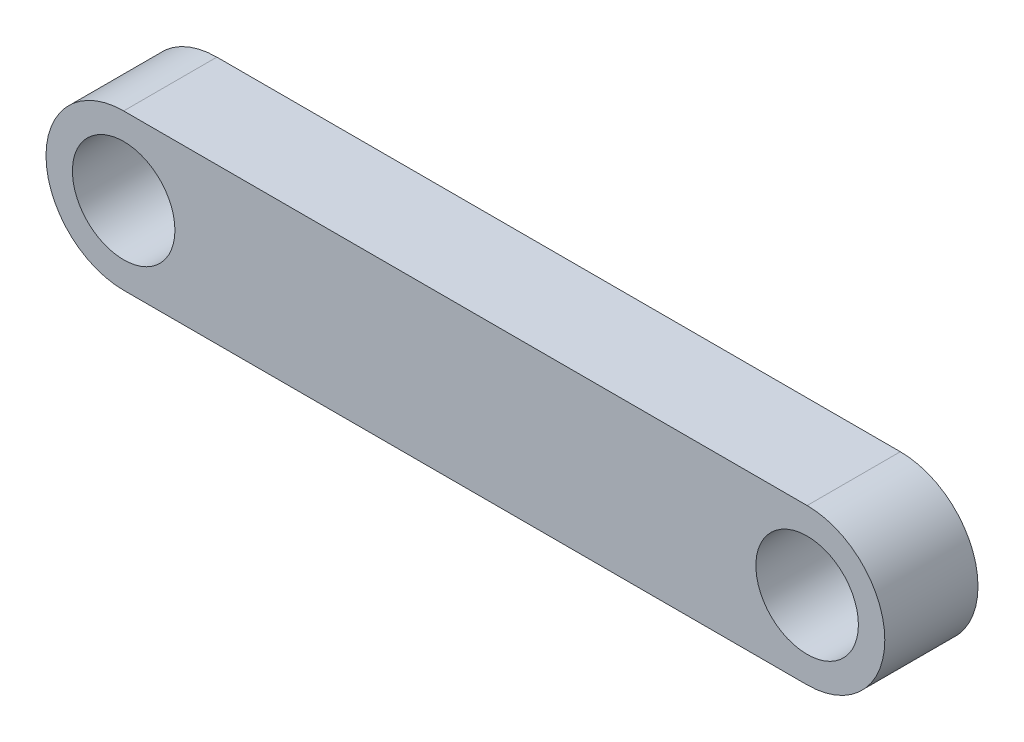
ISO-10303-21;
HEADER;
FILE_DESCRIPTION(('STEP AP214'),'2;1');
FILE_NAME('part.step','',(''),(''),'','','');
FILE_SCHEMA(('AUTOMOTIVE_DESIGN { 1 0 10303 214 1 1 1 1 }'));
ENDSEC;
DATA;
#1=APPLICATION_CONTEXT('core data for automotive mechanical design processes');
#2=APPLICATION_PROTOCOL_DEFINITION('international standard','automotive_design',2000,#1);
#3=PRODUCT_CONTEXT('',#1,'mechanical');
#4=PRODUCT('Part','Part','',(#3));
#5=PRODUCT_RELATED_PRODUCT_CATEGORY('part','',(#4));
#6=PRODUCT_DEFINITION_FORMATION('','',#4);
#7=PRODUCT_DEFINITION_CONTEXT('part definition',#1,'design');
#8=PRODUCT_DEFINITION('design','',#6,#7);
#9=PRODUCT_DEFINITION_SHAPE('','',#8);
#10=(LENGTH_UNIT() NAMED_UNIT(*) SI_UNIT(.MILLI.,.METRE.));
#11=(NAMED_UNIT(*) PLANE_ANGLE_UNIT() SI_UNIT($,.RADIAN.));
#12=(NAMED_UNIT(*) SI_UNIT($,.STERADIAN.) SOLID_ANGLE_UNIT());
#13=UNCERTAINTY_MEASURE_WITH_UNIT(LENGTH_MEASURE(1.E-05),#10,'distance_accuracy_value','');
#14=(GEOMETRIC_REPRESENTATION_CONTEXT(3) GLOBAL_UNCERTAINTY_ASSIGNED_CONTEXT((#13)) GLOBAL_UNIT_ASSIGNED_CONTEXT((#10,
#11,#12)) REPRESENTATION_CONTEXT('',''));
#15=CARTESIAN_POINT('',(0.,0.,0.));
#16=DIRECTION('',(0.,0.,1.));
#17=DIRECTION('',(1.,0.,0.));
#18=AXIS2_PLACEMENT_3D('',#15,#16,#17);
#19=CARTESIAN_POINT('',(0.,0.,3.));
#20=DIRECTION('',(0.,0.,1.));
#21=DIRECTION('',(1.,0.,0.));
#22=AXIS2_PLACEMENT_3D('',#19,#20,#21);
#23=PLANE('',#22);
#24=CARTESIAN_POINT('',(0.,0.,3.));
#25=DIRECTION('',(0.,0.,1.));
#26=DIRECTION('',(1.,0.,0.));
#27=AXIS2_PLACEMENT_3D('',#24,#25,#26);
#28=CIRCLE('',#27,1.65);
#29=CARTESIAN_POINT('',(1.65,0.,3.));
#30=VERTEX_POINT('',#29);
#31=EDGE_CURVE('E108',#30,#30,#28,.T.);
#32=ORIENTED_EDGE('',*,*,#31,.F.);
#33=EDGE_LOOP('',(#32));
#34=FACE_BOUND('',#33,.T.);
#35=CARTESIAN_POINT('',(0.,0.,3.));
#36=DIRECTION('',(0.,0.,1.));
#37=DIRECTION('',(1.,0.,0.));
#38=AXIS2_PLACEMENT_3D('',#35,#36,#37);
#39=CIRCLE('',#38,2.5);
#40=CARTESIAN_POINT('',(0.,2.5,3.));
#41=VERTEX_POINT('',#40);
#42=CARTESIAN_POINT('',(0.,-2.5,3.));
#43=VERTEX_POINT('',#42);
#44=EDGE_CURVE('E93',#41,#43,#39,.T.);
#45=ORIENTED_EDGE('',*,*,#44,.T.);
#46=DIRECTION('',(1.,0.,0.));
#47=VECTOR('',#46,1.);
#48=CARTESIAN_POINT('',(22.,-2.5,3.));
#49=LINE('',#48,#47);
#50=CARTESIAN_POINT('',(22.,-2.5,3.));
#51=VERTEX_POINT('',#50);
#52=EDGE_CURVE('E88',#43,#51,#49,.T.);
#53=ORIENTED_EDGE('',*,*,#52,.T.);
#54=CARTESIAN_POINT('',(22.,0.,3.));
#55=DIRECTION('',(0.,0.,1.));
#56=DIRECTION('',(1.,0.,0.));
#57=AXIS2_PLACEMENT_3D('',#54,#55,#56);
#58=CIRCLE('',#57,2.5);
#59=CARTESIAN_POINT('',(22.,2.5,3.));
#60=VERTEX_POINT('',#59);
#61=EDGE_CURVE('E91',#51,#60,#58,.T.);
#62=ORIENTED_EDGE('',*,*,#61,.T.);
#63=DIRECTION('',(-1.,0.,0.));
#64=VECTOR('',#63,1.);
#65=CARTESIAN_POINT('',(0.,2.5,3.));
#66=LINE('',#65,#64);
#67=EDGE_CURVE('E58',#60,#41,#66,.T.);
#68=ORIENTED_EDGE('',*,*,#67,.T.);
#69=EDGE_LOOP('',(#45,#53,#62,#68));
#70=FACE_BOUND('',#69,.T.);
#71=CARTESIAN_POINT('',(22.,0.,3.));
#72=DIRECTION('',(0.,0.,1.));
#73=DIRECTION('',(1.,0.,0.));
#74=AXIS2_PLACEMENT_3D('',#71,#72,#73);
#75=CIRCLE('',#74,1.65);
#76=CARTESIAN_POINT('',(23.65,0.,3.));
#77=VERTEX_POINT('',#76);
#78=EDGE_CURVE('E123',#77,#77,#75,.T.);
#79=ORIENTED_EDGE('',*,*,#78,.F.);
#80=EDGE_LOOP('',(#79));
#81=FACE_BOUND('',#80,.T.);
#82=ADVANCED_FACE('F41',(#34,#70,#81),#23,.T.);
#83=CARTESIAN_POINT('',(0.,0.,0.));
#84=DIRECTION('',(0.,0.,1.));
#85=DIRECTION('',(1.,0.,0.));
#86=AXIS2_PLACEMENT_3D('',#83,#84,#85);
#87=PLANE('',#86);
#88=CARTESIAN_POINT('',(0.,0.,0.));
#89=DIRECTION('',(0.,0.,1.));
#90=DIRECTION('',(1.,0.,0.));
#91=AXIS2_PLACEMENT_3D('',#88,#89,#90);
#92=CIRCLE('',#91,2.5);
#93=CARTESIAN_POINT('',(0.,2.5,0.));
#94=VERTEX_POINT('',#93);
#95=CARTESIAN_POINT('',(0.,-2.5,0.));
#96=VERTEX_POINT('',#95);
#97=EDGE_CURVE('E105',#94,#96,#92,.T.);
#98=ORIENTED_EDGE('',*,*,#97,.F.);
#99=DIRECTION('',(-1.,0.,0.));
#100=VECTOR('',#99,1.);
#101=CARTESIAN_POINT('',(0.,2.5,0.));
#102=LINE('',#101,#100);
#103=CARTESIAN_POINT('',(22.,2.5,0.));
#104=VERTEX_POINT('',#103);
#105=EDGE_CURVE('E81',#104,#94,#102,.T.);
#106=ORIENTED_EDGE('',*,*,#105,.F.);
#107=CARTESIAN_POINT('',(22.,0.,0.));
#108=DIRECTION('',(0.,0.,1.));
#109=DIRECTION('',(1.,0.,0.));
#110=AXIS2_PLACEMENT_3D('',#107,#108,#109);
#111=CIRCLE('',#110,2.5);
#112=CARTESIAN_POINT('',(22.,-2.5,0.));
#113=VERTEX_POINT('',#112);
#114=EDGE_CURVE('E75',#113,#104,#111,.T.);
#115=ORIENTED_EDGE('',*,*,#114,.F.);
#116=DIRECTION('',(1.,0.,0.));
#117=VECTOR('',#116,1.);
#118=CARTESIAN_POINT('',(22.,-2.5,0.));
#119=LINE('',#118,#117);
#120=EDGE_CURVE('E97',#96,#113,#119,.T.);
#121=ORIENTED_EDGE('',*,*,#120,.F.);
#122=EDGE_LOOP('',(#98,#106,#115,#121));
#123=FACE_BOUND('',#122,.T.);
#124=CARTESIAN_POINT('',(0.,0.,0.));
#125=DIRECTION('',(0.,0.,1.));
#126=DIRECTION('',(1.,0.,0.));
#127=AXIS2_PLACEMENT_3D('',#124,#125,#126);
#128=CIRCLE('',#127,1.65);
#129=CARTESIAN_POINT('',(1.65,0.,0.));
#130=VERTEX_POINT('',#129);
#131=EDGE_CURVE('E120',#130,#130,#128,.T.);
#132=ORIENTED_EDGE('',*,*,#131,.T.);
#133=EDGE_LOOP('',(#132));
#134=FACE_BOUND('',#133,.T.);
#135=CARTESIAN_POINT('',(22.,0.,0.));
#136=DIRECTION('',(0.,0.,1.));
#137=DIRECTION('',(1.,0.,0.));
#138=AXIS2_PLACEMENT_3D('',#135,#136,#137);
#139=CIRCLE('',#138,1.65);
#140=CARTESIAN_POINT('',(23.65,0.,0.));
#141=VERTEX_POINT('',#140);
#142=EDGE_CURVE('E126',#141,#141,#139,.T.);
#143=ORIENTED_EDGE('',*,*,#142,.T.);
#144=EDGE_LOOP('',(#143));
#145=FACE_BOUND('',#144,.T.);
#146=ADVANCED_FACE('F116',(#123,#134,#145),#87,.F.);
#147=CARTESIAN_POINT('',(0.,0.,3.));
#148=DIRECTION('',(0.,0.,-1.));
#149=DIRECTION('',(-1.,0.,0.));
#150=AXIS2_PLACEMENT_3D('',#147,#148,#149);
#151=CYLINDRICAL_SURFACE('',#150,2.5);
#152=ORIENTED_EDGE('',*,*,#97,.T.);
#153=DIRECTION('',(0.,0.,-1.));
#154=VECTOR('',#153,1.);
#155=CARTESIAN_POINT('',(0.,-2.5,3.));
#156=LINE('',#155,#154);
#157=EDGE_CURVE('E11',#43,#96,#156,.T.);
#158=ORIENTED_EDGE('',*,*,#157,.F.);
#159=ORIENTED_EDGE('',*,*,#44,.F.);
#160=DIRECTION('',(0.,0.,-1.));
#161=VECTOR('',#160,1.);
#162=CARTESIAN_POINT('',(0.,2.5,3.));
#163=LINE('',#162,#161);
#164=EDGE_CURVE('E101',#41,#94,#163,.T.);
#165=ORIENTED_EDGE('',*,*,#164,.T.);
#166=EDGE_LOOP('',(#152,#158,#159,#165));
#167=FACE_BOUND('',#166,.T.);
#168=ADVANCED_FACE('F43',(#167),#151,.T.);
#169=CARTESIAN_POINT('',(22.,-2.5,3.));
#170=DIRECTION('',(0.,1.,0.));
#171=DIRECTION('',(0.,0.,1.));
#172=AXIS2_PLACEMENT_3D('',#169,#170,#171);
#173=PLANE('',#172);
#174=ORIENTED_EDGE('',*,*,#120,.T.);
#175=DIRECTION('',(0.,0.,-1.));
#176=VECTOR('',#175,1.);
#177=CARTESIAN_POINT('',(22.,-2.5,3.));
#178=LINE('',#177,#176);
#179=EDGE_CURVE('E50',#51,#113,#178,.T.);
#180=ORIENTED_EDGE('',*,*,#179,.F.);
#181=ORIENTED_EDGE('',*,*,#52,.F.);
#182=ORIENTED_EDGE('',*,*,#157,.T.);
#183=EDGE_LOOP('',(#174,#180,#181,#182));
#184=FACE_BOUND('',#183,.T.);
#185=ADVANCED_FACE('F96',(#184),#173,.F.);
#186=CARTESIAN_POINT('',(22.,0.,3.));
#187=DIRECTION('',(0.,0.,-1.));
#188=DIRECTION('',(-1.,0.,0.));
#189=AXIS2_PLACEMENT_3D('',#186,#187,#188);
#190=CYLINDRICAL_SURFACE('',#189,2.5);
#191=ORIENTED_EDGE('',*,*,#114,.T.);
#192=DIRECTION('',(0.,0.,-1.));
#193=VECTOR('',#192,1.);
#194=CARTESIAN_POINT('',(22.,2.5,3.));
#195=LINE('',#194,#193);
#196=EDGE_CURVE('E98',#60,#104,#195,.T.);
#197=ORIENTED_EDGE('',*,*,#196,.F.);
#198=ORIENTED_EDGE('',*,*,#61,.F.);
#199=ORIENTED_EDGE('',*,*,#179,.T.);
#200=EDGE_LOOP('',(#191,#197,#198,#199));
#201=FACE_BOUND('',#200,.T.);
#202=ADVANCED_FACE('F99',(#201),#190,.T.);
#203=CARTESIAN_POINT('',(0.,2.5,3.));
#204=DIRECTION('',(0.,-1.,0.));
#205=DIRECTION('',(0.,0.,-1.));
#206=AXIS2_PLACEMENT_3D('',#203,#204,#205);
#207=PLANE('',#206);
#208=ORIENTED_EDGE('',*,*,#105,.T.);
#209=ORIENTED_EDGE('',*,*,#164,.F.);
#210=ORIENTED_EDGE('',*,*,#67,.F.);
#211=ORIENTED_EDGE('',*,*,#196,.T.);
#212=EDGE_LOOP('',(#208,#209,#210,#211));
#213=FACE_BOUND('',#212,.T.);
#214=ADVANCED_FACE('F113',(#213),#207,.F.);
#215=CARTESIAN_POINT('',(0.,0.,3.));
#216=DIRECTION('',(0.,0.,-1.));
#217=DIRECTION('',(-1.,0.,0.));
#218=AXIS2_PLACEMENT_3D('',#215,#216,#217);
#219=CYLINDRICAL_SURFACE('',#218,1.65);
#220=ORIENTED_EDGE('',*,*,#31,.T.);
#221=EDGE_LOOP('',(#220));
#222=FACE_BOUND('',#221,.T.);
#223=ORIENTED_EDGE('',*,*,#131,.F.);
#224=EDGE_LOOP('',(#223));
#225=FACE_BOUND('',#224,.T.);
#226=ADVANCED_FACE('F143',(#222,#225),#219,.F.);
#227=CARTESIAN_POINT('',(22.,0.,3.));
#228=DIRECTION('',(0.,0.,-1.));
#229=DIRECTION('',(-1.,0.,0.));
#230=AXIS2_PLACEMENT_3D('',#227,#228,#229);
#231=CYLINDRICAL_SURFACE('',#230,1.65);
#232=ORIENTED_EDGE('',*,*,#78,.T.);
#233=EDGE_LOOP('',(#232));
#234=FACE_BOUND('',#233,.T.);
#235=ORIENTED_EDGE('',*,*,#142,.F.);
#236=EDGE_LOOP('',(#235));
#237=FACE_BOUND('',#236,.T.);
#238=ADVANCED_FACE('F132',(#234,#237),#231,.F.);
#239=CLOSED_SHELL('',(#82,#146,#168,#185,#202,#214,#226,#238));
#240=MANIFOLD_SOLID_BREP('B2',#239);
#241=ADVANCED_BREP_SHAPE_REPRESENTATION('',(#18,#240),#14);
#242=SHAPE_DEFINITION_REPRESENTATION(#9,#241);
ENDSEC;
END-ISO-10303-21;
